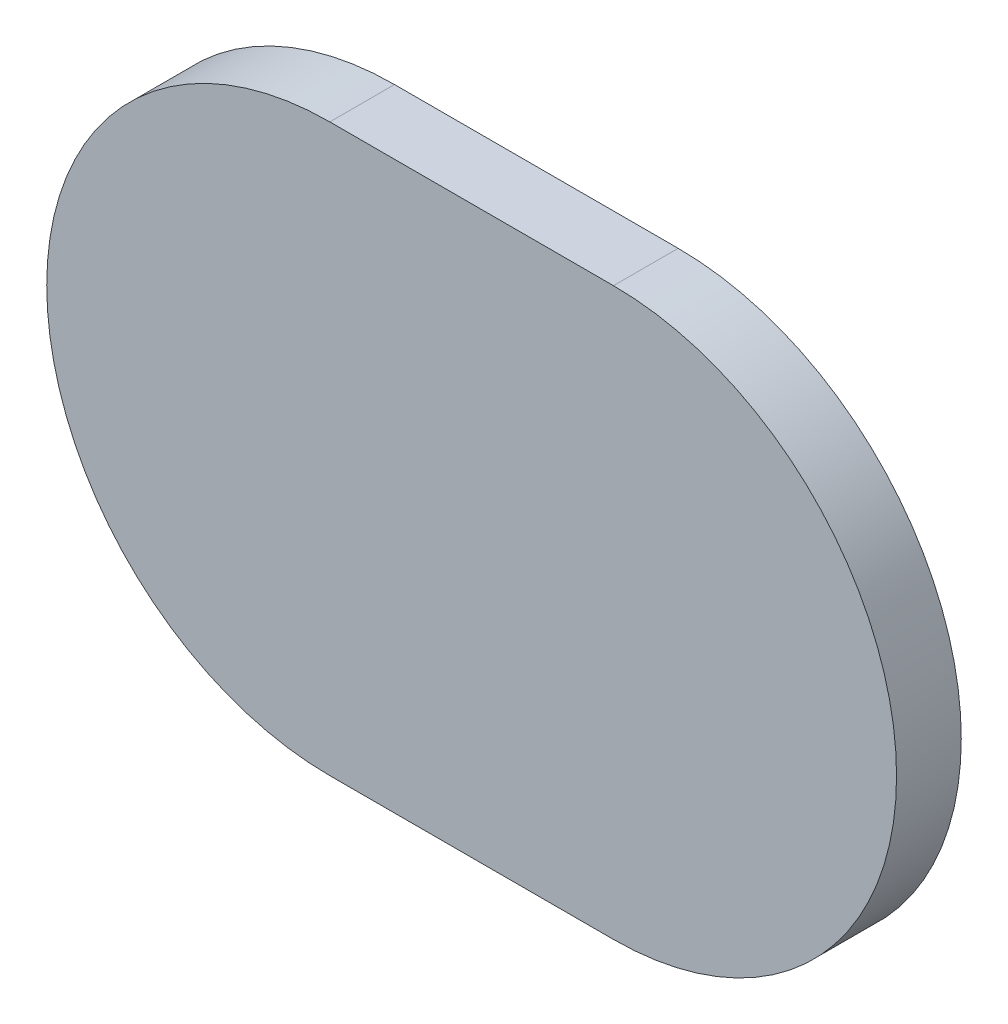
ISO-10303-21;
HEADER;
FILE_DESCRIPTION(('STEP AP214'),'2;1');
FILE_NAME('part.step','',(''),(''),'','','');
FILE_SCHEMA(('AUTOMOTIVE_DESIGN { 1 0 10303 214 1 1 1 1 }'));
ENDSEC;
DATA;
#1=APPLICATION_CONTEXT('core data for automotive mechanical design processes');
#2=APPLICATION_PROTOCOL_DEFINITION('international standard','automotive_design',2000,#1);
#3=PRODUCT_CONTEXT('',#1,'mechanical');
#4=PRODUCT('Part','Part','',(#3));
#5=PRODUCT_RELATED_PRODUCT_CATEGORY('part','',(#4));
#6=PRODUCT_DEFINITION_FORMATION('','',#4);
#7=PRODUCT_DEFINITION_CONTEXT('part definition',#1,'design');
#8=PRODUCT_DEFINITION('design','',#6,#7);
#9=PRODUCT_DEFINITION_SHAPE('','',#8);
#10=(LENGTH_UNIT() NAMED_UNIT(*) SI_UNIT(.MILLI.,.METRE.));
#11=(NAMED_UNIT(*) PLANE_ANGLE_UNIT() SI_UNIT($,.RADIAN.));
#12=(NAMED_UNIT(*) SI_UNIT($,.STERADIAN.) SOLID_ANGLE_UNIT());
#13=UNCERTAINTY_MEASURE_WITH_UNIT(LENGTH_MEASURE(1.E-05),#10,'distance_accuracy_value','');
#14=(GEOMETRIC_REPRESENTATION_CONTEXT(3) GLOBAL_UNCERTAINTY_ASSIGNED_CONTEXT((#13)) GLOBAL_UNIT_ASSIGNED_CONTEXT((#10,
#11,#12)) REPRESENTATION_CONTEXT('',''));
#15=CARTESIAN_POINT('',(0.,0.,0.));
#16=DIRECTION('',(0.,0.,1.));
#17=DIRECTION('',(1.,0.,0.));
#18=AXIS2_PLACEMENT_3D('',#15,#16,#17);
#19=CARTESIAN_POINT('',(0.,0.,1.27));
#20=DIRECTION('',(0.,0.,-1.));
#21=DIRECTION('',(-1.,0.,0.));
#22=AXIS2_PLACEMENT_3D('',#19,#20,#21);
#23=CYLINDRICAL_SURFACE('',#22,5.55625000000004);
#24=CARTESIAN_POINT('',(0.,0.,0.));
#25=DIRECTION('',(0.,0.,1.));
#26=DIRECTION('',(1.,0.,0.));
#27=AXIS2_PLACEMENT_3D('',#24,#25,#26);
#28=CIRCLE('',#27,5.55625000000004);
#29=CARTESIAN_POINT('',(0.,-5.55625000000004,0.));
#30=VERTEX_POINT('',#29);
#31=CARTESIAN_POINT('',(0.,5.55625000000004,0.));
#32=VERTEX_POINT('',#31);
#33=EDGE_CURVE('E96',#30,#32,#28,.T.);
#34=ORIENTED_EDGE('',*,*,#33,.T.);
#35=DIRECTION('',(0.,0.,-1.));
#36=VECTOR('',#35,1.);
#37=CARTESIAN_POINT('',(0.,5.55625000000004,1.27));
#38=LINE('',#37,#36);
#39=CARTESIAN_POINT('',(0.,5.55625000000004,1.27));
#40=VERTEX_POINT('',#39);
#41=EDGE_CURVE('E11',#40,#32,#38,.T.);
#42=ORIENTED_EDGE('',*,*,#41,.F.);
#43=CARTESIAN_POINT('',(0.,0.,1.27));
#44=DIRECTION('',(0.,0.,1.));
#45=DIRECTION('',(1.,0.,0.));
#46=AXIS2_PLACEMENT_3D('',#43,#44,#45);
#47=CIRCLE('',#46,5.55625000000004);
#48=CARTESIAN_POINT('',(0.,-5.55625000000004,1.27));
#49=VERTEX_POINT('',#48);
#50=EDGE_CURVE('E84',#49,#40,#47,.T.);
#51=ORIENTED_EDGE('',*,*,#50,.F.);
#52=DIRECTION('',(0.,0.,-1.));
#53=VECTOR('',#52,1.);
#54=CARTESIAN_POINT('',(0.,-5.55625000000004,1.27));
#55=LINE('',#54,#53);
#56=EDGE_CURVE('E92',#49,#30,#55,.T.);
#57=ORIENTED_EDGE('',*,*,#56,.T.);
#58=EDGE_LOOP('',(#34,#42,#51,#57));
#59=FACE_BOUND('',#58,.T.);
#60=ADVANCED_FACE('F33',(#59),#23,.T.);
#61=CARTESIAN_POINT('',(0.,5.55625000000004,1.27));
#62=DIRECTION('',(0.,-1.,0.));
#63=DIRECTION('',(1.,0.,0.));
#64=AXIS2_PLACEMENT_3D('',#61,#62,#63);
#65=PLANE('',#64);
#66=DIRECTION('',(-1.,0.,0.));
#67=VECTOR('',#66,1.);
#68=CARTESIAN_POINT('',(0.,5.55625000000004,0.));
#69=LINE('',#68,#67);
#70=CARTESIAN_POINT('',(-5.56714,5.55625,0.));
#71=VERTEX_POINT('',#70);
#72=EDGE_CURVE('E88',#32,#71,#69,.T.);
#73=ORIENTED_EDGE('',*,*,#72,.T.);
#74=DIRECTION('',(0.,0.,-1.));
#75=VECTOR('',#74,1.);
#76=CARTESIAN_POINT('',(-5.56714,5.55625,1.27));
#77=LINE('',#76,#75);
#78=CARTESIAN_POINT('',(-5.56714,5.55625,1.27));
#79=VERTEX_POINT('',#78);
#80=EDGE_CURVE('E41',#79,#71,#77,.T.);
#81=ORIENTED_EDGE('',*,*,#80,.F.);
#82=DIRECTION('',(-1.,0.,0.));
#83=VECTOR('',#82,1.);
#84=CARTESIAN_POINT('',(0.,5.55625000000004,1.27));
#85=LINE('',#84,#83);
#86=EDGE_CURVE('E79',#40,#79,#85,.T.);
#87=ORIENTED_EDGE('',*,*,#86,.F.);
#88=ORIENTED_EDGE('',*,*,#41,.T.);
#89=EDGE_LOOP('',(#73,#81,#87,#88));
#90=FACE_BOUND('',#89,.T.);
#91=ADVANCED_FACE('F87',(#90),#65,.F.);
#92=CARTESIAN_POINT('',(-5.56714,0.,1.27));
#93=DIRECTION('',(0.,0.,-1.));
#94=DIRECTION('',(-1.,0.,0.));
#95=AXIS2_PLACEMENT_3D('',#92,#93,#94);
#96=CYLINDRICAL_SURFACE('',#95,5.55625);
#97=CARTESIAN_POINT('',(-5.56714,0.,0.));
#98=DIRECTION('',(0.,0.,1.));
#99=DIRECTION('',(1.,0.,0.));
#100=AXIS2_PLACEMENT_3D('',#97,#98,#99);
#101=CIRCLE('',#100,5.55625);
#102=CARTESIAN_POINT('',(-5.56714,-5.55625000000004,0.));
#103=VERTEX_POINT('',#102);
#104=EDGE_CURVE('E66',#71,#103,#101,.T.);
#105=ORIENTED_EDGE('',*,*,#104,.T.);
#106=DIRECTION('',(0.,0.,-1.));
#107=VECTOR('',#106,1.);
#108=CARTESIAN_POINT('',(-5.56714,-5.55625000000004,1.27));
#109=LINE('',#108,#107);
#110=CARTESIAN_POINT('',(-5.56714,-5.55625000000004,1.27));
#111=VERTEX_POINT('',#110);
#112=EDGE_CURVE('E89',#111,#103,#109,.T.);
#113=ORIENTED_EDGE('',*,*,#112,.F.);
#114=CARTESIAN_POINT('',(-5.56714,0.,1.27));
#115=DIRECTION('',(0.,0.,1.));
#116=DIRECTION('',(1.,0.,0.));
#117=AXIS2_PLACEMENT_3D('',#114,#115,#116);
#118=CIRCLE('',#117,5.55625);
#119=EDGE_CURVE('E82',#79,#111,#118,.T.);
#120=ORIENTED_EDGE('',*,*,#119,.F.);
#121=ORIENTED_EDGE('',*,*,#80,.T.);
#122=EDGE_LOOP('',(#105,#113,#120,#121));
#123=FACE_BOUND('',#122,.T.);
#124=ADVANCED_FACE('F90',(#123),#96,.T.);
#125=CARTESIAN_POINT('',(0.,-5.55625000000004,1.27));
#126=DIRECTION('',(0.,1.,0.));
#127=DIRECTION('',(-1.,0.,0.));
#128=AXIS2_PLACEMENT_3D('',#125,#126,#127);
#129=PLANE('',#128);
#130=DIRECTION('',(1.,0.,0.));
#131=VECTOR('',#130,1.);
#132=CARTESIAN_POINT('',(0.,-5.55625000000004,0.));
#133=LINE('',#132,#131);
#134=EDGE_CURVE('E72',#103,#30,#133,.T.);
#135=ORIENTED_EDGE('',*,*,#134,.T.);
#136=ORIENTED_EDGE('',*,*,#56,.F.);
#137=DIRECTION('',(1.,0.,0.));
#138=VECTOR('',#137,1.);
#139=CARTESIAN_POINT('',(0.,-5.55625000000004,1.27));
#140=LINE('',#139,#138);
#141=EDGE_CURVE('E49',#111,#49,#140,.T.);
#142=ORIENTED_EDGE('',*,*,#141,.F.);
#143=ORIENTED_EDGE('',*,*,#112,.T.);
#144=EDGE_LOOP('',(#135,#136,#142,#143));
#145=FACE_BOUND('',#144,.T.);
#146=ADVANCED_FACE('F103',(#145),#129,.F.);
#147=CARTESIAN_POINT('',(0.,0.,1.27));
#148=DIRECTION('',(0.,0.,1.));
#149=DIRECTION('',(1.,0.,0.));
#150=AXIS2_PLACEMENT_3D('',#147,#148,#149);
#151=PLANE('',#150);
#152=ORIENTED_EDGE('',*,*,#50,.T.);
#153=ORIENTED_EDGE('',*,*,#86,.T.);
#154=ORIENTED_EDGE('',*,*,#119,.T.);
#155=ORIENTED_EDGE('',*,*,#141,.T.);
#156=EDGE_LOOP('',(#152,#153,#154,#155));
#157=FACE_BOUND('',#156,.T.);
#158=ADVANCED_FACE('F80',(#157),#151,.T.);
#159=CARTESIAN_POINT('',(0.,0.,0.));
#160=DIRECTION('',(0.,0.,1.));
#161=DIRECTION('',(1.,0.,0.));
#162=AXIS2_PLACEMENT_3D('',#159,#160,#161);
#163=PLANE('',#162);
#164=ORIENTED_EDGE('',*,*,#33,.F.);
#165=ORIENTED_EDGE('',*,*,#134,.F.);
#166=ORIENTED_EDGE('',*,*,#104,.F.);
#167=ORIENTED_EDGE('',*,*,#72,.F.);
#168=EDGE_LOOP('',(#164,#165,#166,#167));
#169=FACE_BOUND('',#168,.T.);
#170=ADVANCED_FACE('F106',(#169),#163,.F.);
#171=CLOSED_SHELL('',(#60,#91,#124,#146,#158,#170));
#172=MANIFOLD_SOLID_BREP('B2',#171);
#173=ADVANCED_BREP_SHAPE_REPRESENTATION('',(#18,#172),#14);
#174=SHAPE_DEFINITION_REPRESENTATION(#9,#173);
ENDSEC;
END-ISO-10303-21;
